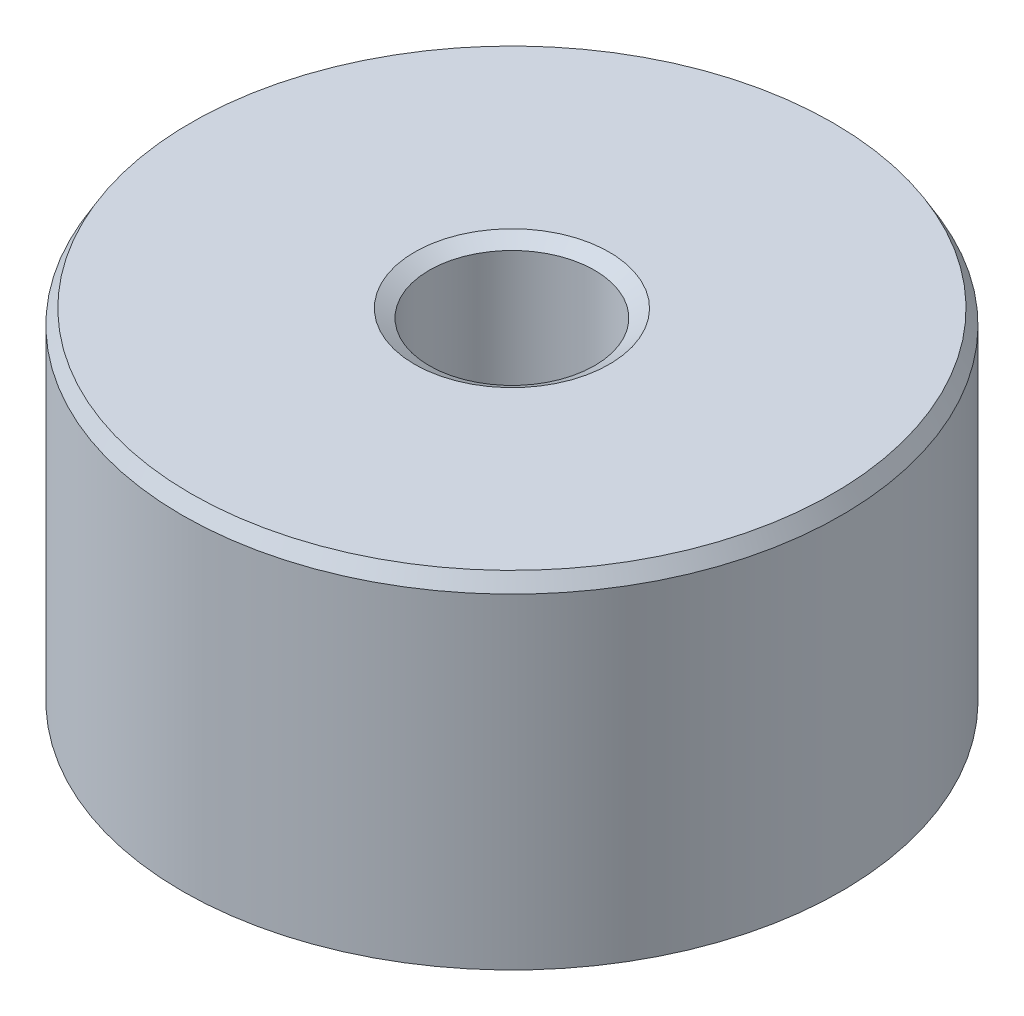
ISO-10303-21;
HEADER;
FILE_DESCRIPTION(('STEP AP214'),'2;1');
FILE_NAME('part.step','',(''),(''),'','','');
FILE_SCHEMA(('AUTOMOTIVE_DESIGN { 1 0 10303 214 1 1 1 1 }'));
ENDSEC;
DATA;
#1=APPLICATION_CONTEXT('core data for automotive mechanical design processes');
#2=APPLICATION_PROTOCOL_DEFINITION('international standard','automotive_design',2000,#1);
#3=PRODUCT_CONTEXT('',#1,'mechanical');
#4=PRODUCT('Part','Part','',(#3));
#5=PRODUCT_RELATED_PRODUCT_CATEGORY('part','',(#4));
#6=PRODUCT_DEFINITION_FORMATION('','',#4);
#7=PRODUCT_DEFINITION_CONTEXT('part definition',#1,'design');
#8=PRODUCT_DEFINITION('design','',#6,#7);
#9=PRODUCT_DEFINITION_SHAPE('','',#8);
#10=(LENGTH_UNIT() NAMED_UNIT(*) SI_UNIT(.MILLI.,.METRE.));
#11=(NAMED_UNIT(*) PLANE_ANGLE_UNIT() SI_UNIT($,.RADIAN.));
#12=(NAMED_UNIT(*) SI_UNIT($,.STERADIAN.) SOLID_ANGLE_UNIT());
#13=UNCERTAINTY_MEASURE_WITH_UNIT(LENGTH_MEASURE(1.E-05),#10,'distance_accuracy_value','');
#14=(GEOMETRIC_REPRESENTATION_CONTEXT(3) GLOBAL_UNCERTAINTY_ASSIGNED_CONTEXT((#13)) GLOBAL_UNIT_ASSIGNED_CONTEXT((#10,
#11,#12)) REPRESENTATION_CONTEXT('',''));
#15=CARTESIAN_POINT('',(0.,0.,0.));
#16=DIRECTION('',(0.,0.,1.));
#17=DIRECTION('',(1.,0.,0.));
#18=AXIS2_PLACEMENT_3D('',#15,#16,#17);
#19=CARTESIAN_POINT('',(0.,5.28824038431934,0.));
#20=DIRECTION('',(0.,-1.,0.));
#21=DIRECTION('',(0.,0.,-1.));
#22=AXIS2_PLACEMENT_3D('',#19,#20,#21);
#23=CYLINDRICAL_SURFACE('',#22,5.);
#24=CARTESIAN_POINT('',(0.,0.128089455646065,0.));
#25=DIRECTION('',(0.,1.,0.));
#26=DIRECTION('',(0.,0.,1.));
#27=AXIS2_PLACEMENT_3D('',#24,#25,#26);
#28=CIRCLE('',#27,5.);
#29=CARTESIAN_POINT('',(0.,0.128089455646065,5.));
#30=VERTEX_POINT('',#29);
#31=EDGE_CURVE('E10',#30,#30,#28,.T.);
#32=ORIENTED_EDGE('',*,*,#31,.T.);
#33=EDGE_LOOP('',(#32));
#34=FACE_BOUND('',#33,.T.);
#35=CARTESIAN_POINT('',(0.,5.06638293922652,0.));
#36=DIRECTION('',(0.,1.,0.));
#37=DIRECTION('',(0.,0.,1.));
#38=AXIS2_PLACEMENT_3D('',#35,#36,#37);
#39=CIRCLE('',#38,5.);
#40=CARTESIAN_POINT('',(0.,5.06638293922652,5.));
#41=VERTEX_POINT('',#40);
#42=EDGE_CURVE('E50',#41,#41,#39,.F.);
#43=ORIENTED_EDGE('',*,*,#42,.T.);
#44=EDGE_LOOP('',(#43));
#45=FACE_BOUND('',#44,.T.);
#46=ADVANCED_FACE('F39',(#34,#45),#23,.T.);
#47=CARTESIAN_POINT('',(0.,5.28824038431934,0.));
#48=DIRECTION('',(0.,1.,0.));
#49=DIRECTION('',(0.,0.,1.));
#50=AXIS2_PLACEMENT_3D('',#47,#48,#49);
#51=PLANE('',#50);
#52=CARTESIAN_POINT('',(0.,5.28824038431934,0.));
#53=DIRECTION('',(0.,1.,0.));
#54=DIRECTION('',(0.,0.,1.));
#55=AXIS2_PLACEMENT_3D('',#52,#53,#54);
#56=CIRCLE('',#55,1.47648254993025);
#57=CARTESIAN_POINT('',(0.,5.28824038431934,1.47648254993025));
#58=VERTEX_POINT('',#57);
#59=EDGE_CURVE('E58',#58,#58,#56,.F.);
#60=ORIENTED_EDGE('',*,*,#59,.T.);
#61=EDGE_LOOP('',(#60));
#62=FACE_BOUND('',#61,.T.);
#63=CARTESIAN_POINT('',(0.,5.28824038431934,0.));
#64=DIRECTION('',(0.,1.,0.));
#65=DIRECTION('',(0.,0.,1.));
#66=AXIS2_PLACEMENT_3D('',#63,#64,#65);
#67=CIRCLE('',#66,4.87191054435394);
#68=CARTESIAN_POINT('',(0.,5.28824038431934,4.87191054435394));
#69=VERTEX_POINT('',#68);
#70=EDGE_CURVE('E61',#69,#69,#67,.T.);
#71=ORIENTED_EDGE('',*,*,#70,.T.);
#72=EDGE_LOOP('',(#71));
#73=FACE_BOUND('',#72,.T.);
#74=ADVANCED_FACE('F88',(#62,#73),#51,.T.);
#75=CARTESIAN_POINT('',(0.,0.,0.));
#76=DIRECTION('',(0.,1.,0.));
#77=DIRECTION('',(0.,0.,1.));
#78=AXIS2_PLACEMENT_3D('',#75,#76,#77);
#79=PLANE('',#78);
#80=CARTESIAN_POINT('',(0.,0.,0.));
#81=DIRECTION('',(0.,1.,0.));
#82=DIRECTION('',(0.,0.,1.));
#83=AXIS2_PLACEMENT_3D('',#80,#81,#82);
#84=CIRCLE('',#83,1.38271456048349);
#85=CARTESIAN_POINT('',(0.,0.,-1.38271456048349));
#86=VERTEX_POINT('',#85);
#87=EDGE_CURVE('E51',#86,#86,#84,.T.);
#88=ORIENTED_EDGE('',*,*,#87,.T.);
#89=EDGE_LOOP('',(#88));
#90=FACE_BOUND('',#89,.T.);
#91=CARTESIAN_POINT('',(0.,0.,0.));
#92=DIRECTION('',(0.,1.,0.));
#93=DIRECTION('',(0.,0.,1.));
#94=AXIS2_PLACEMENT_3D('',#91,#92,#93);
#95=CIRCLE('',#94,4.77814255490717);
#96=CARTESIAN_POINT('',(0.,0.,4.77814255490717));
#97=VERTEX_POINT('',#96);
#98=EDGE_CURVE('E54',#97,#97,#95,.F.);
#99=ORIENTED_EDGE('',*,*,#98,.T.);
#100=EDGE_LOOP('',(#99));
#101=FACE_BOUND('',#100,.T.);
#102=ADVANCED_FACE('F83',(#90,#101),#79,.F.);
#103=CARTESIAN_POINT('',(0.,5.28824038431934,0.));
#104=DIRECTION('',(0.,-1.,0.));
#105=DIRECTION('',(0.,0.,-1.));
#106=AXIS2_PLACEMENT_3D('',#103,#104,#105);
#107=CYLINDRICAL_SURFACE('',#106,1.25462510483743);
#108=CARTESIAN_POINT('',(0.,5.16015092867328,0.));
#109=DIRECTION('',(0.,1.,0.));
#110=DIRECTION('',(0.,0.,1.));
#111=AXIS2_PLACEMENT_3D('',#108,#109,#110);
#112=CIRCLE('',#111,1.25462510483743);
#113=CARTESIAN_POINT('',(0.,5.16015092867328,1.25462510483743));
#114=VERTEX_POINT('',#113);
#115=EDGE_CURVE('E67',#114,#114,#112,.T.);
#116=ORIENTED_EDGE('',*,*,#115,.T.);
#117=EDGE_LOOP('',(#116));
#118=FACE_BOUND('',#117,.T.);
#119=CARTESIAN_POINT('',(0.,0.221857445092827,0.));
#120=DIRECTION('',(0.,1.,0.));
#121=DIRECTION('',(0.,0.,1.));
#122=AXIS2_PLACEMENT_3D('',#119,#120,#121);
#123=CIRCLE('',#122,1.25462510483743);
#124=CARTESIAN_POINT('',(0.,0.221857445092827,-1.25462510483743));
#125=VERTEX_POINT('',#124);
#126=EDGE_CURVE('E69',#125,#125,#123,.F.);
#127=ORIENTED_EDGE('',*,*,#126,.T.);
#128=EDGE_LOOP('',(#127));
#129=FACE_BOUND('',#128,.T.);
#130=ADVANCED_FACE('F71',(#118,#129),#107,.F.);
#131=CARTESIAN_POINT('',(0.,5.16015092867328,0.));
#132=DIRECTION('',(0.,1.,0.));
#133=DIRECTION('',(0.,0.,1.));
#134=AXIS2_PLACEMENT_3D('',#131,#132,#133);
#135=CONICAL_SURFACE('',#134,1.25462510483743,1.0471975511966);
#136=ORIENTED_EDGE('',*,*,#59,.F.);
#137=EDGE_LOOP('',(#136));
#138=FACE_BOUND('',#137,.T.);
#139=ORIENTED_EDGE('',*,*,#115,.F.);
#140=EDGE_LOOP('',(#139));
#141=FACE_BOUND('',#140,.T.);
#142=ADVANCED_FACE('F77',(#138,#141),#135,.F.);
#143=CARTESIAN_POINT('',(0.,0.,0.));
#144=DIRECTION('',(0.,-1.,0.));
#145=DIRECTION('',(0.,0.,-1.));
#146=AXIS2_PLACEMENT_3D('',#143,#144,#145);
#147=CONICAL_SURFACE('',#146,1.38271456048349,0.523598775598294);
#148=CARTESIAN_POINT('',(0.,0.221857445092827,-1.25462510483743));
#149=CARTESIAN_POINT('',(0.,0.219546430039777,-1.25595937000041));
#150=CARTESIAN_POINT('',(0.,0.217235414986726,-1.25729363516339));
#151=CARTESIAN_POINT('',(0.,0.212613384880626,-1.25996216548935));
#152=CARTESIAN_POINT('',(0.,0.210302369827576,-1.26129643065232));
#153=CARTESIAN_POINT('',(0.,0.205680339721475,-1.26396496097828));
#154=CARTESIAN_POINT('',(0.,0.203369324668425,-1.26529922614126));
#155=CARTESIAN_POINT('',(0.,0.198747294562324,-1.26796775646722));
#156=CARTESIAN_POINT('',(0.,0.196436279509274,-1.2693020216302));
#157=CARTESIAN_POINT('',(0.,0.191814249403173,-1.27197055195616));
#158=CARTESIAN_POINT('',(0.,0.189503234350123,-1.27330481711914));
#159=CARTESIAN_POINT('',(0.,0.184881204244022,-1.2759733474451));
#160=CARTESIAN_POINT('',(0.,0.182570189190972,-1.27730761260808));
#161=CARTESIAN_POINT('',(0.,0.177948159084872,-1.27997614293404));
#162=CARTESIAN_POINT('',(0.,0.175637144031821,-1.28131040809702));
#163=CARTESIAN_POINT('',(0.,0.171015113925721,-1.28397893842298));
#164=CARTESIAN_POINT('',(0.,0.16870409887267,-1.28531320358596));
#165=CARTESIAN_POINT('',(0.,0.16408206876657,-1.28798173391192));
#166=CARTESIAN_POINT('',(0.,0.16177105371352,-1.2893159990749));
#167=CARTESIAN_POINT('',(0.,0.157149023607419,-1.29198452940086));
#168=CARTESIAN_POINT('',(0.,0.154838008554369,-1.29331879456384));
#169=CARTESIAN_POINT('',(0.,0.150215978448268,-1.2959873248898));
#170=CARTESIAN_POINT('',(0.,0.147904963395218,-1.29732159005278));
#171=CARTESIAN_POINT('',(0.,0.143282933289117,-1.29999012037874));
#172=CARTESIAN_POINT('',(0.,0.140971918236067,-1.30132438554172));
#173=CARTESIAN_POINT('',(0.,0.136349888129967,-1.30399291586768));
#174=CARTESIAN_POINT('',(0.,0.134038873076916,-1.30532718103066));
#175=CARTESIAN_POINT('',(0.,0.129416842970816,-1.30799571135662));
#176=CARTESIAN_POINT('',(0.,0.127105827917765,-1.3093299765196));
#177=CARTESIAN_POINT('',(0.,0.122483797811665,-1.31199850684556));
#178=CARTESIAN_POINT('',(0.,0.120172782758615,-1.31333277200854));
#179=CARTESIAN_POINT('',(0.,0.115550752652514,-1.3160013023345));
#180=CARTESIAN_POINT('',(0.,0.113239737599464,-1.31733556749748));
#181=CARTESIAN_POINT('',(0.,0.108617707493363,-1.32000409782344));
#182=CARTESIAN_POINT('',(0.,0.106306692440313,-1.32133836298642));
#183=CARTESIAN_POINT('',(0.,0.101684662334212,-1.32400689331238));
#184=CARTESIAN_POINT('',(0.,0.099373647281162,-1.32534115847536));
#185=CARTESIAN_POINT('',(0.,0.0947516171750615,-1.32800968880132));
#186=CARTESIAN_POINT('',(0.,0.0924406021220112,-1.3293439539643));
#187=CARTESIAN_POINT('',(0.,0.0878185720159107,-1.33201248429026));
#188=CARTESIAN_POINT('',(0.,0.0855075569628604,-1.33334674945324));
#189=CARTESIAN_POINT('',(0.,0.0808855268567598,-1.3360152797792));
#190=CARTESIAN_POINT('',(0.,0.0785745118037095,-1.33734954494218));
#191=CARTESIAN_POINT('',(0.,0.073952481697609,-1.34001807526814));
#192=CARTESIAN_POINT('',(0.,0.0716414666445587,-1.34135234043112));
#193=CARTESIAN_POINT('',(0.,0.0670194365384581,-1.34402087075708));
#194=CARTESIAN_POINT('',(0.,0.0647084214854078,-1.34535513592005));
#195=CARTESIAN_POINT('',(0.,0.0600863913793073,-1.34802366624601));
#196=CARTESIAN_POINT('',(0.,0.057775376326257,-1.34935793140899));
#197=CARTESIAN_POINT('',(0.,0.0531533462201565,-1.35202646173495));
#198=CARTESIAN_POINT('',(0.,0.0508423311671062,-1.35336072689793));
#199=CARTESIAN_POINT('',(0.,0.0462203010610056,-1.35602925722389));
#200=CARTESIAN_POINT('',(0.,0.0439092860079553,-1.35736352238687));
#201=CARTESIAN_POINT('',(0.,0.0392872559018547,-1.36003205271283));
#202=CARTESIAN_POINT('',(0.,0.0369762408488045,-1.36136631787581));
#203=CARTESIAN_POINT('',(0.,0.0323542107427039,-1.36403484820177));
#204=CARTESIAN_POINT('',(0.,0.0300431956896537,-1.36536911336475));
#205=CARTESIAN_POINT('',(0.,0.0254211655835531,-1.36803764369071));
#206=CARTESIAN_POINT('',(0.,0.0231101505305028,-1.36937190885369));
#207=CARTESIAN_POINT('',(0.,0.0184881204244022,-1.37204043917965));
#208=CARTESIAN_POINT('',(0.,0.016177105371352,-1.37337470434263));
#209=CARTESIAN_POINT('',(0.,0.0115550752652514,-1.37604323466859));
#210=CARTESIAN_POINT('',(0.,0.00924406021220112,-1.37737749983157));
#211=CARTESIAN_POINT('',(0.,0.00462203010610053,-1.38004603015753));
#212=CARTESIAN_POINT('',(0.,0.00231101505305022,-1.38138029532051));
#213=CARTESIAN_POINT('',(0.,0.,-1.38271456048349));
#214=B_SPLINE_CURVE_WITH_KNOTS('',3,(#148,#149,#150,#151,#152,#153,#154,#155,#156,#157,#158,
#159,#160,#161,#162,#163,#164,#165,#166,#167,#168,#169,#170,#171,#172,#173,#174,#175,#176,#177,
#178,#179,#180,#181,#182,#183,#184,#185,#186,#187,#188,#189,#190,#191,#192,#193,#194,#195,#196,
#197,#198,#199,#200,#201,#202,#203,#204,#205,#206,#207,#208,#209,#210,#211,#212,#213),
.UNSPECIFIED.,.F.,.F.,(4,2,2,2,2,2,2,2,2,2,2,2,2,2,2,2,2,2,2,2,2,2,2,2,2,2,2,2,2,2,2,2,4),(0.,
0.00800559097787916,0.0160111819557582,0.0240167729336374,0.0320223639115164,0.0400279548893956,
0.0480335458672747,0.0560391368451538,0.0640447278230329,0.0720503188009121,0.0800559097787912,
0.0880615007566703,0.0960670917345495,0.104072682712429,0.112078273690308,0.120083864668187,
0.128089455646066,0.136095046623945,0.144100637601824,0.152106228579703,0.160111819557582,
0.168117410535461,0.176123001513341,0.18412859249122,0.192134183469099,0.200139774446978,
0.208145365424857,0.216150956402736,0.224156547380615,0.232162138358494,0.240167729336374,
0.248173320314253,0.256178911292132),.UNSPECIFIED.);
#215=EDGE_CURVE('BSEAM73',#125,#86,#214,.T.);
#216=ORIENTED_EDGE('',*,*,#126,.F.);
#217=ORIENTED_EDGE('',*,*,#87,.F.);
#218=ORIENTED_EDGE('',*,*,#215,.T.);
#219=ORIENTED_EDGE('',*,*,#215,.F.);
#220=EDGE_LOOP('',(#216,#218,#217,#219));
#221=FACE_BOUND('',#220,.T.);
#222=ADVANCED_FACE('F73',(#221),#147,.F.);
#223=CARTESIAN_POINT('',(0.,0.128089455646065,0.));
#224=DIRECTION('',(0.,1.,0.));
#225=DIRECTION('',(0.,0.,1.));
#226=AXIS2_PLACEMENT_3D('',#223,#224,#225);
#227=CONICAL_SURFACE('',#226,5.,1.0471975511966);
#228=ORIENTED_EDGE('',*,*,#98,.F.);
#229=EDGE_LOOP('',(#228));
#230=FACE_BOUND('',#229,.T.);
#231=ORIENTED_EDGE('',*,*,#31,.F.);
#232=EDGE_LOOP('',(#231));
#233=FACE_BOUND('',#232,.T.);
#234=ADVANCED_FACE('F76',(#230,#233),#227,.T.);
#235=CARTESIAN_POINT('',(0.,5.28824038431934,0.));
#236=DIRECTION('',(0.,-1.,0.));
#237=DIRECTION('',(0.,0.,-1.));
#238=AXIS2_PLACEMENT_3D('',#235,#236,#237);
#239=CONICAL_SURFACE('',#238,4.87191054435394,0.523598775598291);
#240=ORIENTED_EDGE('',*,*,#42,.F.);
#241=EDGE_LOOP('',(#240));
#242=FACE_BOUND('',#241,.T.);
#243=ORIENTED_EDGE('',*,*,#70,.F.);
#244=EDGE_LOOP('',(#243));
#245=FACE_BOUND('',#244,.T.);
#246=ADVANCED_FACE('F45',(#242,#245),#239,.T.);
#247=CLOSED_SHELL('',(#46,#74,#102,#130,#142,#222,#234,#246));
#248=MANIFOLD_SOLID_BREP('B2',#247);
#249=ADVANCED_BREP_SHAPE_REPRESENTATION('',(#18,#248),#14);
#250=SHAPE_DEFINITION_REPRESENTATION(#9,#249);
ENDSEC;
END-ISO-10303-21;
